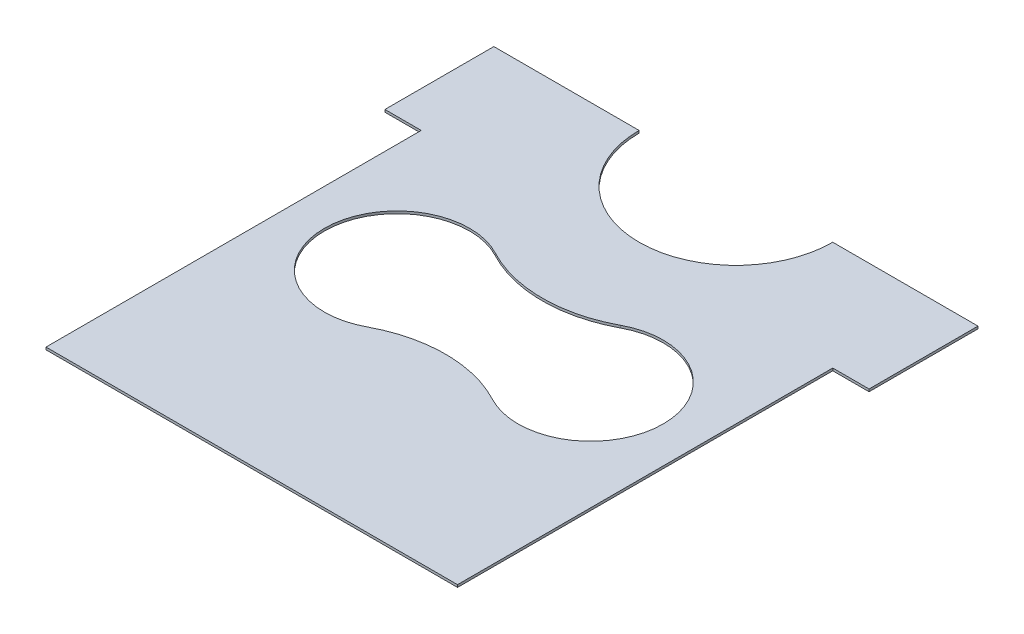
ISO-10303-21;
HEADER;
FILE_DESCRIPTION(('STEP AP214'),'2;1');
FILE_NAME('part.step','',(''),(''),'','','');
FILE_SCHEMA(('AUTOMOTIVE_DESIGN { 1 0 10303 214 1 1 1 1 }'));
ENDSEC;
DATA;
#1=APPLICATION_CONTEXT('core data for automotive mechanical design processes');
#2=APPLICATION_PROTOCOL_DEFINITION('international standard','automotive_design',2000,#1);
#3=PRODUCT_CONTEXT('',#1,'mechanical');
#4=PRODUCT('Part','Part','',(#3));
#5=PRODUCT_RELATED_PRODUCT_CATEGORY('part','',(#4));
#6=PRODUCT_DEFINITION_FORMATION('','',#4);
#7=PRODUCT_DEFINITION_CONTEXT('part definition',#1,'design');
#8=PRODUCT_DEFINITION('design','',#6,#7);
#9=PRODUCT_DEFINITION_SHAPE('','',#8);
#10=(LENGTH_UNIT() NAMED_UNIT(*) SI_UNIT(.MILLI.,.METRE.));
#11=(NAMED_UNIT(*) PLANE_ANGLE_UNIT() SI_UNIT($,.RADIAN.));
#12=(NAMED_UNIT(*) SI_UNIT($,.STERADIAN.) SOLID_ANGLE_UNIT());
#13=UNCERTAINTY_MEASURE_WITH_UNIT(LENGTH_MEASURE(1.E-05),#10,'distance_accuracy_value','');
#14=(GEOMETRIC_REPRESENTATION_CONTEXT(3) GLOBAL_UNCERTAINTY_ASSIGNED_CONTEXT((#13)) GLOBAL_UNIT_ASSIGNED_CONTEXT((#10,
#11,#12)) REPRESENTATION_CONTEXT('',''));
#15=CARTESIAN_POINT('',(0.,0.,0.));
#16=DIRECTION('',(0.,0.,1.));
#17=DIRECTION('',(1.,0.,0.));
#18=AXIS2_PLACEMENT_3D('',#15,#16,#17);
#19=CARTESIAN_POINT('',(1500.,10.,-2000.));
#20=DIRECTION('',(0.,1.,0.));
#21=DIRECTION('',(0.,0.,1.));
#22=AXIS2_PLACEMENT_3D('',#19,#20,#21);
#23=PLANE('',#22);
#24=DIRECTION('',(0.,0.,1.));
#25=VECTOR('',#24,1.);
#26=CARTESIAN_POINT('',(650.,10.,1.04094977927525E-13));
#27=LINE('',#26,#25);
#28=CARTESIAN_POINT('',(650.,10.,-1550.));
#29=VERTEX_POINT('',#28);
#30=CARTESIAN_POINT('',(650.,10.,1.04094977927525E-13));
#31=VERTEX_POINT('',#30);
#32=EDGE_CURVE('E168',#29,#31,#27,.T.);
#33=ORIENTED_EDGE('',*,*,#32,.T.);
#34=DIRECTION('',(1.,0.,0.));
#35=VECTOR('',#34,1.);
#36=CARTESIAN_POINT('',(2350.,10.,1.04094977927525E-13));
#37=LINE('',#36,#35);
#38=CARTESIAN_POINT('',(2350.,10.,1.04094977927525E-13));
#39=VERTEX_POINT('',#38);
#40=EDGE_CURVE('E171',#31,#39,#37,.T.);
#41=ORIENTED_EDGE('',*,*,#40,.T.);
#42=DIRECTION('',(0.,0.,-1.));
#43=VECTOR('',#42,1.);
#44=CARTESIAN_POINT('',(2350.,10.,1.04094977927525E-13));
#45=LINE('',#44,#43);
#46=CARTESIAN_POINT('',(2350.,10.,-1550.));
#47=VERTEX_POINT('',#46);
#48=EDGE_CURVE('E174',#39,#47,#45,.T.);
#49=ORIENTED_EDGE('',*,*,#48,.T.);
#50=DIRECTION('',(1.,0.,0.));
#51=VECTOR('',#50,1.);
#52=CARTESIAN_POINT('',(2350.,10.,-1550.));
#53=LINE('',#52,#51);
#54=CARTESIAN_POINT('',(2500.,10.,-1550.));
#55=VERTEX_POINT('',#54);
#56=EDGE_CURVE('E176',#47,#55,#53,.T.);
#57=ORIENTED_EDGE('',*,*,#56,.T.);
#58=DIRECTION('',(0.,0.,-1.));
#59=VECTOR('',#58,1.);
#60=CARTESIAN_POINT('',(2500.,10.,-1550.));
#61=LINE('',#60,#59);
#62=CARTESIAN_POINT('',(2500.,10.,-2000.));
#63=VERTEX_POINT('',#62);
#64=EDGE_CURVE('E178',#55,#63,#61,.T.);
#65=ORIENTED_EDGE('',*,*,#64,.T.);
#66=DIRECTION('',(-1.,0.,0.));
#67=VECTOR('',#66,1.);
#68=CARTESIAN_POINT('',(2500.,10.,-2000.));
#69=LINE('',#68,#67);
#70=CARTESIAN_POINT('',(1900.,10.,-2000.));
#71=VERTEX_POINT('',#70);
#72=EDGE_CURVE('E180',#63,#71,#69,.T.);
#73=ORIENTED_EDGE('',*,*,#72,.T.);
#74=CARTESIAN_POINT('',(1500.,10.,-2000.));
#75=DIRECTION('',(0.,-1.,0.));
#76=DIRECTION('',(0.,0.,1.));
#77=AXIS2_PLACEMENT_3D('',#74,#75,#76);
#78=CIRCLE('',#77,400.);
#79=CARTESIAN_POINT('',(1100.,10.,-2000.));
#80=VERTEX_POINT('',#79);
#81=EDGE_CURVE('E182',#71,#80,#78,.T.);
#82=ORIENTED_EDGE('',*,*,#81,.T.);
#83=DIRECTION('',(-1.,0.,0.));
#84=VECTOR('',#83,1.);
#85=CARTESIAN_POINT('',(500.,10.,-2000.));
#86=LINE('',#85,#84);
#87=CARTESIAN_POINT('',(500.,10.,-2000.));
#88=VERTEX_POINT('',#87);
#89=EDGE_CURVE('E184',#80,#88,#86,.T.);
#90=ORIENTED_EDGE('',*,*,#89,.T.);
#91=DIRECTION('',(0.,0.,1.));
#92=VECTOR('',#91,1.);
#93=CARTESIAN_POINT('',(500.,10.,-1550.));
#94=LINE('',#93,#92);
#95=CARTESIAN_POINT('',(500.,10.,-1550.));
#96=VERTEX_POINT('',#95);
#97=EDGE_CURVE('E186',#88,#96,#94,.T.);
#98=ORIENTED_EDGE('',*,*,#97,.T.);
#99=DIRECTION('',(1.,0.,0.));
#100=VECTOR('',#99,1.);
#101=CARTESIAN_POINT('',(650.,10.,-1550.));
#102=LINE('',#101,#100);
#103=EDGE_CURVE('E188',#96,#29,#102,.T.);
#104=ORIENTED_EDGE('',*,*,#103,.T.);
#105=EDGE_LOOP('',(#33,#41,#49,#57,#65,#73,#82,#90,#98,#104));
#106=FACE_BOUND('',#105,.T.);
#107=CARTESIAN_POINT('',(1100.,10.,-1000.));
#108=DIRECTION('',(0.,1.,0.));
#109=DIRECTION('',(0.,0.,1.));
#110=AXIS2_PLACEMENT_3D('',#107,#108,#109);
#111=CIRCLE('',#110,300.);
#112=CARTESIAN_POINT('',(1241.17647058824,10.,-1264.70588235294));
#113=VERTEX_POINT('',#112);
#114=CARTESIAN_POINT('',(1241.17647058824,10.,-735.294117647059));
#115=VERTEX_POINT('',#114);
#116=EDGE_CURVE('E140',#113,#115,#111,.T.);
#117=ORIENTED_EDGE('',*,*,#116,.F.);
#118=CARTESIAN_POINT('',(1500.,10.,-1750.));
#119=DIRECTION('',(0.,-1.,0.));
#120=DIRECTION('',(0.,0.,1.));
#121=AXIS2_PLACEMENT_3D('',#118,#119,#120);
#122=CIRCLE('',#121,550.);
#123=CARTESIAN_POINT('',(1758.82352941176,10.,-1264.70588235294));
#124=VERTEX_POINT('',#123);
#125=EDGE_CURVE('E132',#124,#113,#122,.T.);
#126=ORIENTED_EDGE('',*,*,#125,.F.);
#127=CARTESIAN_POINT('',(1900.,10.,-1000.));
#128=DIRECTION('',(0.,1.,0.));
#129=DIRECTION('',(0.,0.,-1.));
#130=AXIS2_PLACEMENT_3D('',#127,#128,#129);
#131=CIRCLE('',#130,300.);
#132=CARTESIAN_POINT('',(1758.82352941176,10.,-735.294117647059));
#133=VERTEX_POINT('',#132);
#134=EDGE_CURVE('E154',#133,#124,#131,.T.);
#135=ORIENTED_EDGE('',*,*,#134,.F.);
#136=CARTESIAN_POINT('',(1500.,10.,-250.));
#137=DIRECTION('',(0.,-1.,0.));
#138=DIRECTION('',(0.,0.,-1.));
#139=AXIS2_PLACEMENT_3D('',#136,#137,#138);
#140=CIRCLE('',#139,550.);
#141=EDGE_CURVE('E152',#115,#133,#140,.T.);
#142=ORIENTED_EDGE('',*,*,#141,.F.);
#143=EDGE_LOOP('',(#117,#126,#135,#142));
#144=FACE_BOUND('',#143,.T.);
#145=ADVANCED_FACE('F31',(#106,#144),#23,.T.);
#146=CARTESIAN_POINT('',(1500.,0.,-2000.));
#147=DIRECTION('',(0.,1.,0.));
#148=DIRECTION('',(0.,0.,1.));
#149=AXIS2_PLACEMENT_3D('',#146,#147,#148);
#150=PLANE('',#149);
#151=DIRECTION('',(0.,0.,1.));
#152=VECTOR('',#151,1.);
#153=CARTESIAN_POINT('',(650.,0.,1.04094977927525E-13));
#154=LINE('',#153,#152);
#155=CARTESIAN_POINT('',(650.,0.,-1550.));
#156=VERTEX_POINT('',#155);
#157=CARTESIAN_POINT('',(650.,0.,1.04094977927525E-13));
#158=VERTEX_POINT('',#157);
#159=EDGE_CURVE('E148',#156,#158,#154,.T.);
#160=ORIENTED_EDGE('',*,*,#159,.F.);
#161=DIRECTION('',(1.,0.,0.));
#162=VECTOR('',#161,1.);
#163=CARTESIAN_POINT('',(650.,0.,-1550.));
#164=LINE('',#163,#162);
#165=CARTESIAN_POINT('',(500.,0.,-1550.));
#166=VERTEX_POINT('',#165);
#167=EDGE_CURVE('E172',#166,#156,#164,.T.);
#168=ORIENTED_EDGE('',*,*,#167,.F.);
#169=DIRECTION('',(0.,0.,1.));
#170=VECTOR('',#169,1.);
#171=CARTESIAN_POINT('',(500.,0.,-1550.));
#172=LINE('',#171,#170);
#173=CARTESIAN_POINT('',(500.,0.,-2000.));
#174=VERTEX_POINT('',#173);
#175=EDGE_CURVE('E207',#174,#166,#172,.T.);
#176=ORIENTED_EDGE('',*,*,#175,.F.);
#177=DIRECTION('',(-1.,0.,0.));
#178=VECTOR('',#177,1.);
#179=CARTESIAN_POINT('',(500.,0.,-2000.));
#180=LINE('',#179,#178);
#181=CARTESIAN_POINT('',(1100.,0.,-2000.));
#182=VERTEX_POINT('',#181);
#183=EDGE_CURVE('E205',#182,#174,#180,.T.);
#184=ORIENTED_EDGE('',*,*,#183,.F.);
#185=CARTESIAN_POINT('',(1500.,0.,-2000.));
#186=DIRECTION('',(0.,-1.,0.));
#187=DIRECTION('',(0.,0.,1.));
#188=AXIS2_PLACEMENT_3D('',#185,#186,#187);
#189=CIRCLE('',#188,400.);
#190=CARTESIAN_POINT('',(1900.,0.,-2000.));
#191=VERTEX_POINT('',#190);
#192=EDGE_CURVE('E203',#191,#182,#189,.T.);
#193=ORIENTED_EDGE('',*,*,#192,.F.);
#194=DIRECTION('',(-1.,0.,0.));
#195=VECTOR('',#194,1.);
#196=CARTESIAN_POINT('',(2500.,0.,-2000.));
#197=LINE('',#196,#195);
#198=CARTESIAN_POINT('',(2500.,0.,-2000.));
#199=VERTEX_POINT('',#198);
#200=EDGE_CURVE('E201',#199,#191,#197,.T.);
#201=ORIENTED_EDGE('',*,*,#200,.F.);
#202=DIRECTION('',(0.,0.,-1.));
#203=VECTOR('',#202,1.);
#204=CARTESIAN_POINT('',(2500.,0.,-1550.));
#205=LINE('',#204,#203);
#206=CARTESIAN_POINT('',(2500.,0.,-1550.));
#207=VERTEX_POINT('',#206);
#208=EDGE_CURVE('E199',#207,#199,#205,.T.);
#209=ORIENTED_EDGE('',*,*,#208,.F.);
#210=DIRECTION('',(1.,0.,0.));
#211=VECTOR('',#210,1.);
#212=CARTESIAN_POINT('',(2350.,0.,-1550.));
#213=LINE('',#212,#211);
#214=CARTESIAN_POINT('',(2350.,0.,-1550.));
#215=VERTEX_POINT('',#214);
#216=EDGE_CURVE('E197',#215,#207,#213,.T.);
#217=ORIENTED_EDGE('',*,*,#216,.F.);
#218=DIRECTION('',(0.,0.,-1.));
#219=VECTOR('',#218,1.);
#220=CARTESIAN_POINT('',(2350.,0.,1.04094977927525E-13));
#221=LINE('',#220,#219);
#222=CARTESIAN_POINT('',(2350.,0.,1.04094977927525E-13));
#223=VERTEX_POINT('',#222);
#224=EDGE_CURVE('E195',#223,#215,#221,.T.);
#225=ORIENTED_EDGE('',*,*,#224,.F.);
#226=DIRECTION('',(1.,0.,0.));
#227=VECTOR('',#226,1.);
#228=CARTESIAN_POINT('',(2350.,0.,1.04094977927525E-13));
#229=LINE('',#228,#227);
#230=EDGE_CURVE('E193',#158,#223,#229,.T.);
#231=ORIENTED_EDGE('',*,*,#230,.F.);
#232=EDGE_LOOP('',(#160,#168,#176,#184,#193,#201,#209,#217,#225,#231));
#233=FACE_BOUND('',#232,.T.);
#234=CARTESIAN_POINT('',(1500.,0.,-1750.));
#235=DIRECTION('',(0.,-1.,0.));
#236=DIRECTION('',(0.,0.,1.));
#237=AXIS2_PLACEMENT_3D('',#234,#235,#236);
#238=CIRCLE('',#237,550.);
#239=CARTESIAN_POINT('',(1758.82352941176,0.,-1264.70588235294));
#240=VERTEX_POINT('',#239);
#241=CARTESIAN_POINT('',(1241.17647058824,0.,-1264.70588235294));
#242=VERTEX_POINT('',#241);
#243=EDGE_CURVE('E54',#240,#242,#238,.T.);
#244=ORIENTED_EDGE('',*,*,#243,.T.);
#245=CARTESIAN_POINT('',(1100.,0.,-1000.));
#246=DIRECTION('',(0.,1.,0.));
#247=DIRECTION('',(0.,0.,1.));
#248=AXIS2_PLACEMENT_3D('',#245,#246,#247);
#249=CIRCLE('',#248,300.);
#250=CARTESIAN_POINT('',(1241.17647058824,0.,-735.294117647059));
#251=VERTEX_POINT('',#250);
#252=EDGE_CURVE('E147',#242,#251,#249,.T.);
#253=ORIENTED_EDGE('',*,*,#252,.T.);
#254=CARTESIAN_POINT('',(1500.,0.,-250.));
#255=DIRECTION('',(0.,-1.,0.));
#256=DIRECTION('',(0.,0.,-1.));
#257=AXIS2_PLACEMENT_3D('',#254,#255,#256);
#258=CIRCLE('',#257,550.);
#259=CARTESIAN_POINT('',(1758.82352941176,0.,-735.294117647059));
#260=VERTEX_POINT('',#259);
#261=EDGE_CURVE('E160',#251,#260,#258,.T.);
#262=ORIENTED_EDGE('',*,*,#261,.T.);
#263=CARTESIAN_POINT('',(1900.,0.,-1000.));
#264=DIRECTION('',(0.,1.,0.));
#265=DIRECTION('',(0.,0.,-1.));
#266=AXIS2_PLACEMENT_3D('',#263,#264,#265);
#267=CIRCLE('',#266,300.);
#268=EDGE_CURVE('E141',#260,#240,#267,.T.);
#269=ORIENTED_EDGE('',*,*,#268,.T.);
#270=EDGE_LOOP('',(#244,#253,#262,#269));
#271=FACE_BOUND('',#270,.T.);
#272=ADVANCED_FACE('F243',(#233,#271),#150,.F.);
#273=CARTESIAN_POINT('',(650.,10.,1.04094977927525E-13));
#274=DIRECTION('',(1.,0.,0.));
#275=DIRECTION('',(0.,0.,-1.));
#276=AXIS2_PLACEMENT_3D('',#273,#274,#275);
#277=PLANE('',#276);
#278=ORIENTED_EDGE('',*,*,#159,.T.);
#279=DIRECTION('',(0.,-1.,0.));
#280=VECTOR('',#279,1.);
#281=CARTESIAN_POINT('',(650.,10.,1.04094977927525E-13));
#282=LINE('',#281,#280);
#283=EDGE_CURVE('E11',#31,#158,#282,.T.);
#284=ORIENTED_EDGE('',*,*,#283,.F.);
#285=ORIENTED_EDGE('',*,*,#32,.F.);
#286=DIRECTION('',(0.,-1.,0.));
#287=VECTOR('',#286,1.);
#288=CARTESIAN_POINT('',(650.,10.,-1550.));
#289=LINE('',#288,#287);
#290=EDGE_CURVE('E190',#29,#156,#289,.T.);
#291=ORIENTED_EDGE('',*,*,#290,.T.);
#292=EDGE_LOOP('',(#278,#284,#285,#291));
#293=FACE_BOUND('',#292,.T.);
#294=ADVANCED_FACE('F33',(#293),#277,.F.);
#295=CARTESIAN_POINT('',(2350.,10.,1.04094977927525E-13));
#296=DIRECTION('',(0.,0.,-1.));
#297=DIRECTION('',(-1.,0.,0.));
#298=AXIS2_PLACEMENT_3D('',#295,#296,#297);
#299=PLANE('',#298);
#300=ORIENTED_EDGE('',*,*,#230,.T.);
#301=DIRECTION('',(0.,-1.,0.));
#302=VECTOR('',#301,1.);
#303=CARTESIAN_POINT('',(2350.,10.,1.04094977927525E-13));
#304=LINE('',#303,#302);
#305=EDGE_CURVE('E39',#39,#223,#304,.T.);
#306=ORIENTED_EDGE('',*,*,#305,.F.);
#307=ORIENTED_EDGE('',*,*,#40,.F.);
#308=ORIENTED_EDGE('',*,*,#283,.T.);
#309=EDGE_LOOP('',(#300,#306,#307,#308));
#310=FACE_BOUND('',#309,.T.);
#311=ADVANCED_FACE('F260',(#310),#299,.F.);
#312=CARTESIAN_POINT('',(2350.,10.,1.04094977927525E-13));
#313=DIRECTION('',(-1.,0.,0.));
#314=DIRECTION('',(0.,0.,1.));
#315=AXIS2_PLACEMENT_3D('',#312,#313,#314);
#316=PLANE('',#315);
#317=ORIENTED_EDGE('',*,*,#224,.T.);
#318=DIRECTION('',(0.,-1.,0.));
#319=VECTOR('',#318,1.);
#320=CARTESIAN_POINT('',(2350.,10.,-1550.));
#321=LINE('',#320,#319);
#322=EDGE_CURVE('E230',#47,#215,#321,.T.);
#323=ORIENTED_EDGE('',*,*,#322,.F.);
#324=ORIENTED_EDGE('',*,*,#48,.F.);
#325=ORIENTED_EDGE('',*,*,#305,.T.);
#326=EDGE_LOOP('',(#317,#323,#324,#325));
#327=FACE_BOUND('',#326,.T.);
#328=ADVANCED_FACE('F237',(#327),#316,.F.);
#329=CARTESIAN_POINT('',(2350.,10.,-1550.));
#330=DIRECTION('',(0.,0.,-1.));
#331=DIRECTION('',(-1.,0.,0.));
#332=AXIS2_PLACEMENT_3D('',#329,#330,#331);
#333=PLANE('',#332);
#334=ORIENTED_EDGE('',*,*,#216,.T.);
#335=DIRECTION('',(0.,-1.,0.));
#336=VECTOR('',#335,1.);
#337=CARTESIAN_POINT('',(2500.,10.,-1550.));
#338=LINE('',#337,#336);
#339=EDGE_CURVE('E227',#55,#207,#338,.T.);
#340=ORIENTED_EDGE('',*,*,#339,.F.);
#341=ORIENTED_EDGE('',*,*,#56,.F.);
#342=ORIENTED_EDGE('',*,*,#322,.T.);
#343=EDGE_LOOP('',(#334,#340,#341,#342));
#344=FACE_BOUND('',#343,.T.);
#345=ADVANCED_FACE('F249',(#344),#333,.F.);
#346=CARTESIAN_POINT('',(2500.,10.,-1550.));
#347=DIRECTION('',(-1.,0.,0.));
#348=DIRECTION('',(0.,0.,1.));
#349=AXIS2_PLACEMENT_3D('',#346,#347,#348);
#350=PLANE('',#349);
#351=ORIENTED_EDGE('',*,*,#208,.T.);
#352=DIRECTION('',(0.,-1.,0.));
#353=VECTOR('',#352,1.);
#354=CARTESIAN_POINT('',(2500.,10.,-2000.));
#355=LINE('',#354,#353);
#356=EDGE_CURVE('E224',#63,#199,#355,.T.);
#357=ORIENTED_EDGE('',*,*,#356,.F.);
#358=ORIENTED_EDGE('',*,*,#64,.F.);
#359=ORIENTED_EDGE('',*,*,#339,.T.);
#360=EDGE_LOOP('',(#351,#357,#358,#359));
#361=FACE_BOUND('',#360,.T.);
#362=ADVANCED_FACE('F253',(#361),#350,.F.);
#363=CARTESIAN_POINT('',(2500.,10.,-2000.));
#364=DIRECTION('',(0.,0.,1.));
#365=DIRECTION('',(1.,0.,0.));
#366=AXIS2_PLACEMENT_3D('',#363,#364,#365);
#367=PLANE('',#366);
#368=ORIENTED_EDGE('',*,*,#200,.T.);
#369=DIRECTION('',(0.,-1.,0.));
#370=VECTOR('',#369,1.);
#371=CARTESIAN_POINT('',(1900.,10.,-2000.));
#372=LINE('',#371,#370);
#373=EDGE_CURVE('E221',#71,#191,#372,.T.);
#374=ORIENTED_EDGE('',*,*,#373,.F.);
#375=ORIENTED_EDGE('',*,*,#72,.F.);
#376=ORIENTED_EDGE('',*,*,#356,.T.);
#377=EDGE_LOOP('',(#368,#374,#375,#376));
#378=FACE_BOUND('',#377,.T.);
#379=ADVANCED_FACE('F283',(#378),#367,.F.);
#380=CARTESIAN_POINT('',(1500.,10.,-2000.));
#381=DIRECTION('',(0.,-1.,0.));
#382=DIRECTION('',(0.,0.,-1.));
#383=AXIS2_PLACEMENT_3D('',#380,#381,#382);
#384=CYLINDRICAL_SURFACE('',#383,400.);
#385=ORIENTED_EDGE('',*,*,#192,.T.);
#386=DIRECTION('',(0.,-1.,0.));
#387=VECTOR('',#386,1.);
#388=CARTESIAN_POINT('',(1100.,10.,-2000.));
#389=LINE('',#388,#387);
#390=EDGE_CURVE('E218',#80,#182,#389,.T.);
#391=ORIENTED_EDGE('',*,*,#390,.F.);
#392=ORIENTED_EDGE('',*,*,#81,.F.);
#393=ORIENTED_EDGE('',*,*,#373,.T.);
#394=EDGE_LOOP('',(#385,#391,#392,#393));
#395=FACE_BOUND('',#394,.T.);
#396=ADVANCED_FACE('F280',(#395),#384,.F.);
#397=CARTESIAN_POINT('',(500.,10.,-2000.));
#398=DIRECTION('',(0.,0.,1.));
#399=DIRECTION('',(1.,0.,0.));
#400=AXIS2_PLACEMENT_3D('',#397,#398,#399);
#401=PLANE('',#400);
#402=ORIENTED_EDGE('',*,*,#183,.T.);
#403=DIRECTION('',(0.,-1.,0.));
#404=VECTOR('',#403,1.);
#405=CARTESIAN_POINT('',(500.,10.,-2000.));
#406=LINE('',#405,#404);
#407=EDGE_CURVE('E215',#88,#174,#406,.T.);
#408=ORIENTED_EDGE('',*,*,#407,.F.);
#409=ORIENTED_EDGE('',*,*,#89,.F.);
#410=ORIENTED_EDGE('',*,*,#390,.T.);
#411=EDGE_LOOP('',(#402,#408,#409,#410));
#412=FACE_BOUND('',#411,.T.);
#413=ADVANCED_FACE('F276',(#412),#401,.F.);
#414=CARTESIAN_POINT('',(500.,10.,-1550.));
#415=DIRECTION('',(1.,0.,0.));
#416=DIRECTION('',(0.,0.,-1.));
#417=AXIS2_PLACEMENT_3D('',#414,#415,#416);
#418=PLANE('',#417);
#419=ORIENTED_EDGE('',*,*,#175,.T.);
#420=DIRECTION('',(0.,-1.,0.));
#421=VECTOR('',#420,1.);
#422=CARTESIAN_POINT('',(500.,10.,-1550.));
#423=LINE('',#422,#421);
#424=EDGE_CURVE('E212',#96,#166,#423,.T.);
#425=ORIENTED_EDGE('',*,*,#424,.F.);
#426=ORIENTED_EDGE('',*,*,#97,.F.);
#427=ORIENTED_EDGE('',*,*,#407,.T.);
#428=EDGE_LOOP('',(#419,#425,#426,#427));
#429=FACE_BOUND('',#428,.T.);
#430=ADVANCED_FACE('F272',(#429),#418,.F.);
#431=CARTESIAN_POINT('',(650.,10.,-1550.));
#432=DIRECTION('',(0.,0.,-1.));
#433=DIRECTION('',(-1.,0.,0.));
#434=AXIS2_PLACEMENT_3D('',#431,#432,#433);
#435=PLANE('',#434);
#436=ORIENTED_EDGE('',*,*,#167,.T.);
#437=ORIENTED_EDGE('',*,*,#290,.F.);
#438=ORIENTED_EDGE('',*,*,#103,.F.);
#439=ORIENTED_EDGE('',*,*,#424,.T.);
#440=EDGE_LOOP('',(#436,#437,#438,#439));
#441=FACE_BOUND('',#440,.T.);
#442=ADVANCED_FACE('F267',(#441),#435,.F.);
#443=CARTESIAN_POINT('',(1500.,10.,-1750.));
#444=DIRECTION('',(0.,-1.,0.));
#445=DIRECTION('',(0.,0.,-1.));
#446=AXIS2_PLACEMENT_3D('',#443,#444,#445);
#447=CYLINDRICAL_SURFACE('',#446,550.);
#448=ORIENTED_EDGE('',*,*,#243,.F.);
#449=DIRECTION('',(0.,-1.,0.));
#450=VECTOR('',#449,1.);
#451=CARTESIAN_POINT('',(1758.82352941176,10.,-1264.70588235294));
#452=LINE('',#451,#450);
#453=EDGE_CURVE('E136',#124,#240,#452,.T.);
#454=ORIENTED_EDGE('',*,*,#453,.F.);
#455=ORIENTED_EDGE('',*,*,#125,.T.);
#456=DIRECTION('',(0.,-1.,0.));
#457=VECTOR('',#456,1.);
#458=CARTESIAN_POINT('',(1241.17647058824,10.,-1264.70588235294));
#459=LINE('',#458,#457);
#460=EDGE_CURVE('E135',#113,#242,#459,.T.);
#461=ORIENTED_EDGE('',*,*,#460,.T.);
#462=EDGE_LOOP('',(#448,#454,#455,#461));
#463=FACE_BOUND('',#462,.T.);
#464=ADVANCED_FACE('F134',(#463),#447,.T.);
#465=CARTESIAN_POINT('',(1100.,10.,-1000.));
#466=DIRECTION('',(0.,-1.,0.));
#467=DIRECTION('',(0.,0.,-1.));
#468=AXIS2_PLACEMENT_3D('',#465,#466,#467);
#469=CYLINDRICAL_SURFACE('',#468,300.);
#470=ORIENTED_EDGE('',*,*,#252,.F.);
#471=ORIENTED_EDGE('',*,*,#460,.F.);
#472=ORIENTED_EDGE('',*,*,#116,.T.);
#473=DIRECTION('',(0.,-1.,0.));
#474=VECTOR('',#473,1.);
#475=CARTESIAN_POINT('',(1241.17647058824,10.,-735.294117647059));
#476=LINE('',#475,#474);
#477=EDGE_CURVE('E149',#115,#251,#476,.T.);
#478=ORIENTED_EDGE('',*,*,#477,.T.);
#479=EDGE_LOOP('',(#470,#471,#472,#478));
#480=FACE_BOUND('',#479,.T.);
#481=ADVANCED_FACE('F144',(#480),#469,.F.);
#482=CARTESIAN_POINT('',(1500.,10.,-250.));
#483=DIRECTION('',(0.,-1.,0.));
#484=DIRECTION('',(0.,0.,-1.));
#485=AXIS2_PLACEMENT_3D('',#482,#483,#484);
#486=CYLINDRICAL_SURFACE('',#485,550.);
#487=ORIENTED_EDGE('',*,*,#261,.F.);
#488=ORIENTED_EDGE('',*,*,#477,.F.);
#489=ORIENTED_EDGE('',*,*,#141,.T.);
#490=DIRECTION('',(0.,-1.,0.));
#491=VECTOR('',#490,1.);
#492=CARTESIAN_POINT('',(1758.82352941176,10.,-735.294117647059));
#493=LINE('',#492,#491);
#494=EDGE_CURVE('E46',#133,#260,#493,.T.);
#495=ORIENTED_EDGE('',*,*,#494,.T.);
#496=EDGE_LOOP('',(#487,#488,#489,#495));
#497=FACE_BOUND('',#496,.T.);
#498=ADVANCED_FACE('F329',(#497),#486,.T.);
#499=CARTESIAN_POINT('',(1900.,10.,-1000.));
#500=DIRECTION('',(0.,-1.,0.));
#501=DIRECTION('',(0.,0.,-1.));
#502=AXIS2_PLACEMENT_3D('',#499,#500,#501);
#503=CYLINDRICAL_SURFACE('',#502,300.);
#504=ORIENTED_EDGE('',*,*,#268,.F.);
#505=ORIENTED_EDGE('',*,*,#494,.F.);
#506=ORIENTED_EDGE('',*,*,#134,.T.);
#507=ORIENTED_EDGE('',*,*,#453,.T.);
#508=EDGE_LOOP('',(#504,#505,#506,#507));
#509=FACE_BOUND('',#508,.T.);
#510=ADVANCED_FACE('F335',(#509),#503,.F.);
#511=CLOSED_SHELL('',(#145,#272,#294,#311,#328,#345,#362,#379,#396,#413,#430,#442,#464,#481,
#498,#510));
#512=MANIFOLD_SOLID_BREP('B2',#511);
#513=ADVANCED_BREP_SHAPE_REPRESENTATION('',(#18,#512),#14);
#514=SHAPE_DEFINITION_REPRESENTATION(#9,#513);
ENDSEC;
END-ISO-10303-21;
